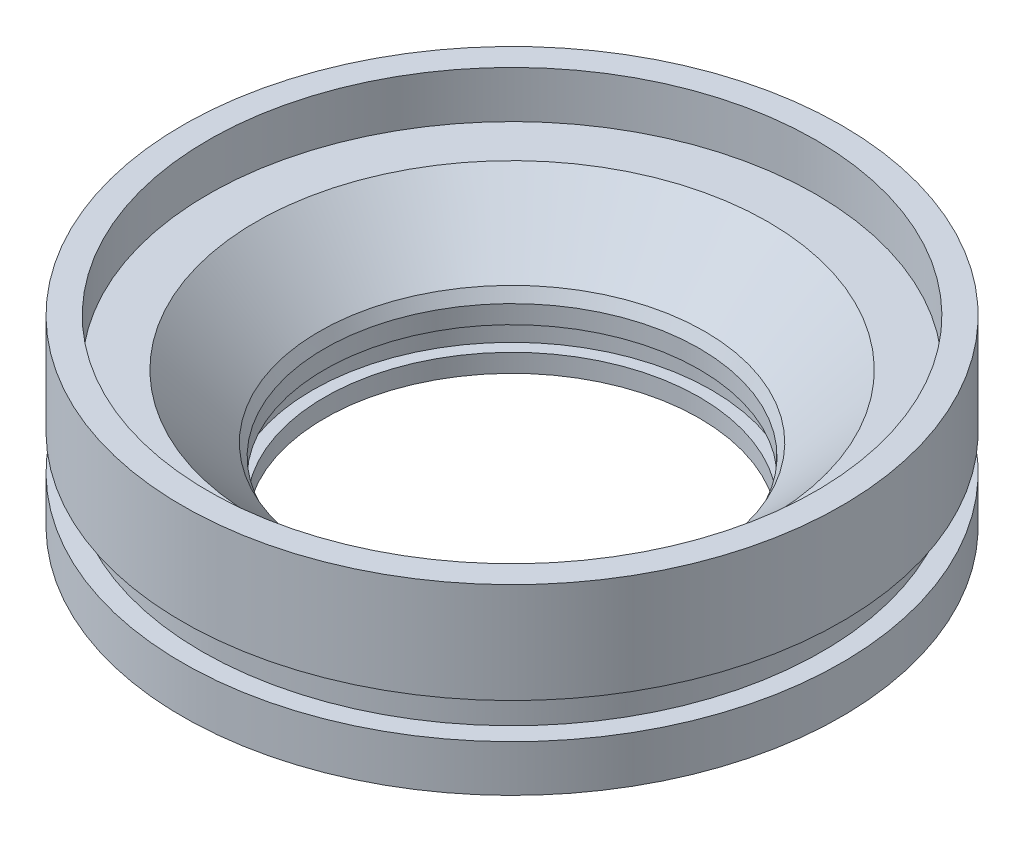
ISO-10303-21;
HEADER;
FILE_DESCRIPTION(('STEP AP214'),'2;1');
FILE_NAME('part.step','',(''),(''),'','','');
FILE_SCHEMA(('AUTOMOTIVE_DESIGN { 1 0 10303 214 1 1 1 1 }'));
ENDSEC;
DATA;
#1=APPLICATION_CONTEXT('core data for automotive mechanical design processes');
#2=APPLICATION_PROTOCOL_DEFINITION('international standard','automotive_design',2000,#1);
#3=PRODUCT_CONTEXT('',#1,'mechanical');
#4=PRODUCT('Part','Part','',(#3));
#5=PRODUCT_RELATED_PRODUCT_CATEGORY('part','',(#4));
#6=PRODUCT_DEFINITION_FORMATION('','',#4);
#7=PRODUCT_DEFINITION_CONTEXT('part definition',#1,'design');
#8=PRODUCT_DEFINITION('design','',#6,#7);
#9=PRODUCT_DEFINITION_SHAPE('','',#8);
#10=(LENGTH_UNIT() NAMED_UNIT(*) SI_UNIT(.MILLI.,.METRE.));
#11=(NAMED_UNIT(*) PLANE_ANGLE_UNIT() SI_UNIT($,.RADIAN.));
#12=(NAMED_UNIT(*) SI_UNIT($,.STERADIAN.) SOLID_ANGLE_UNIT());
#13=UNCERTAINTY_MEASURE_WITH_UNIT(LENGTH_MEASURE(1.E-05),#10,'distance_accuracy_value','');
#14=(GEOMETRIC_REPRESENTATION_CONTEXT(3) GLOBAL_UNCERTAINTY_ASSIGNED_CONTEXT((#13)) GLOBAL_UNIT_ASSIGNED_CONTEXT((#10,
#11,#12)) REPRESENTATION_CONTEXT('',''));
#15=CARTESIAN_POINT('',(0.,0.,0.));
#16=DIRECTION('',(0.,0.,1.));
#17=DIRECTION('',(1.,0.,0.));
#18=AXIS2_PLACEMENT_3D('',#15,#16,#17);
#19=CARTESIAN_POINT('',(45.8597,0.,0.));
#20=DIRECTION('',(0.,-1.,0.));
#21=DIRECTION('',(0.,0.,-1.));
#22=AXIS2_PLACEMENT_3D('',#19,#20,#21);
#23=PLANE('',#22);
#24=CARTESIAN_POINT('',(0.,0.,0.));
#25=DIRECTION('',(0.,-1.,0.));
#26=DIRECTION('',(0.,0.,-1.));
#27=AXIS2_PLACEMENT_3D('',#24,#25,#26);
#28=CIRCLE('',#27,45.8597);
#29=CARTESIAN_POINT('',(0.,0.,-45.8597));
#30=VERTEX_POINT('',#29);
#31=EDGE_CURVE('E84',#30,#30,#28,.T.);
#32=ORIENTED_EDGE('',*,*,#31,.T.);
#33=EDGE_LOOP('',(#32));
#34=FACE_BOUND('',#33,.T.);
#35=CARTESIAN_POINT('',(0.,0.,0.));
#36=DIRECTION('',(0.,-1.,0.));
#37=DIRECTION('',(0.,0.,-1.));
#38=AXIS2_PLACEMENT_3D('',#35,#36,#37);
#39=CIRCLE('',#38,26.0731);
#40=CARTESIAN_POINT('',(0.,0.,-26.0731));
#41=VERTEX_POINT('',#40);
#42=EDGE_CURVE('E10',#41,#41,#39,.T.);
#43=ORIENTED_EDGE('',*,*,#42,.F.);
#44=EDGE_LOOP('',(#43));
#45=FACE_BOUND('',#44,.T.);
#46=ADVANCED_FACE('F32',(#34,#45),#23,.T.);
#47=CARTESIAN_POINT('',(0.,0.,0.));
#48=DIRECTION('',(0.,-1.,0.));
#49=DIRECTION('',(0.,0.,-1.));
#50=AXIS2_PLACEMENT_3D('',#47,#48,#49);
#51=CYLINDRICAL_SURFACE('',#50,26.0731);
#52=ORIENTED_EDGE('',*,*,#42,.T.);
#53=EDGE_LOOP('',(#52));
#54=FACE_BOUND('',#53,.T.);
#55=CARTESIAN_POINT('',(0.,2.54,0.));
#56=DIRECTION('',(0.,-1.,0.));
#57=DIRECTION('',(0.,0.,-1.));
#58=AXIS2_PLACEMENT_3D('',#55,#56,#57);
#59=CIRCLE('',#58,26.0731);
#60=CARTESIAN_POINT('',(0.,2.54,-26.0731));
#61=VERTEX_POINT('',#60);
#62=EDGE_CURVE('E38',#61,#61,#59,.T.);
#63=ORIENTED_EDGE('',*,*,#62,.F.);
#64=EDGE_LOOP('',(#63));
#65=FACE_BOUND('',#64,.T.);
#66=ADVANCED_FACE('F102',(#54,#65),#51,.F.);
#67=CARTESIAN_POINT('',(26.0731,2.54,0.));
#68=DIRECTION('',(0.,1.,0.));
#69=DIRECTION('',(0.,0.,1.));
#70=AXIS2_PLACEMENT_3D('',#67,#68,#69);
#71=PLANE('',#70);
#72=ORIENTED_EDGE('',*,*,#62,.T.);
#73=EDGE_LOOP('',(#72));
#74=FACE_BOUND('',#73,.T.);
#75=CARTESIAN_POINT('',(0.,2.54,0.));
#76=DIRECTION('',(0.,-1.,0.));
#77=DIRECTION('',(0.,0.,-1.));
#78=AXIS2_PLACEMENT_3D('',#75,#76,#77);
#79=CIRCLE('',#78,27.7723101921424);
#80=CARTESIAN_POINT('',(0.,2.54,-27.7723101921424));
#81=VERTEX_POINT('',#80);
#82=EDGE_CURVE('E42',#81,#81,#79,.T.);
#83=ORIENTED_EDGE('',*,*,#82,.F.);
#84=EDGE_LOOP('',(#83));
#85=FACE_BOUND('',#84,.T.);
#86=ADVANCED_FACE('F106',(#74,#85),#71,.T.);
#87=CARTESIAN_POINT('',(0.,0.,0.));
#88=DIRECTION('',(0.,-1.,0.));
#89=DIRECTION('',(0.,0.,-1.));
#90=AXIS2_PLACEMENT_3D('',#87,#88,#89);
#91=CYLINDRICAL_SURFACE('',#90,27.7723101921424);
#92=ORIENTED_EDGE('',*,*,#82,.T.);
#93=EDGE_LOOP('',(#92));
#94=FACE_BOUND('',#93,.T.);
#95=CARTESIAN_POINT('',(0.,5.8674,0.));
#96=DIRECTION('',(0.,-1.,0.));
#97=DIRECTION('',(0.,0.,-1.));
#98=AXIS2_PLACEMENT_3D('',#95,#96,#97);
#99=CIRCLE('',#98,27.7723101921424);
#100=CARTESIAN_POINT('',(0.,5.8674,-27.7723101921424));
#101=VERTEX_POINT('',#100);
#102=EDGE_CURVE('E46',#101,#101,#99,.T.);
#103=ORIENTED_EDGE('',*,*,#102,.F.);
#104=EDGE_LOOP('',(#103));
#105=FACE_BOUND('',#104,.T.);
#106=ADVANCED_FACE('F110',(#94,#105),#91,.F.);
#107=CARTESIAN_POINT('',(27.7723101921424,5.8674,0.));
#108=DIRECTION('',(0.,-1.,0.));
#109=DIRECTION('',(0.,0.,-1.));
#110=AXIS2_PLACEMENT_3D('',#107,#108,#109);
#111=PLANE('',#110);
#112=ORIENTED_EDGE('',*,*,#102,.T.);
#113=EDGE_LOOP('',(#112));
#114=FACE_BOUND('',#113,.T.);
#115=CARTESIAN_POINT('',(0.,5.8674,0.));
#116=DIRECTION('',(0.,-1.,0.));
#117=DIRECTION('',(0.,0.,-1.));
#118=AXIS2_PLACEMENT_3D('',#115,#116,#117);
#119=CIRCLE('',#118,26.0731);
#120=CARTESIAN_POINT('',(0.,5.8674,-26.0731));
#121=VERTEX_POINT('',#120);
#122=EDGE_CURVE('E51',#121,#121,#119,.T.);
#123=ORIENTED_EDGE('',*,*,#122,.F.);
#124=EDGE_LOOP('',(#123));
#125=FACE_BOUND('',#124,.T.);
#126=ADVANCED_FACE('F116',(#114,#125),#111,.T.);
#127=CARTESIAN_POINT('',(0.,0.,0.));
#128=DIRECTION('',(0.,-1.,0.));
#129=DIRECTION('',(0.,0.,-1.));
#130=AXIS2_PLACEMENT_3D('',#127,#128,#129);
#131=CYLINDRICAL_SURFACE('',#130,26.0731);
#132=ORIENTED_EDGE('',*,*,#122,.T.);
#133=EDGE_LOOP('',(#132));
#134=FACE_BOUND('',#133,.T.);
#135=CARTESIAN_POINT('',(0.,8.4074,0.));
#136=DIRECTION('',(0.,-1.,0.));
#137=DIRECTION('',(0.,0.,-1.));
#138=AXIS2_PLACEMENT_3D('',#135,#136,#137);
#139=CIRCLE('',#138,26.0731);
#140=CARTESIAN_POINT('',(0.,8.4074,-26.0731));
#141=VERTEX_POINT('',#140);
#142=EDGE_CURVE('E54',#141,#141,#139,.T.);
#143=ORIENTED_EDGE('',*,*,#142,.F.);
#144=EDGE_LOOP('',(#143));
#145=FACE_BOUND('',#144,.T.);
#146=ADVANCED_FACE('F120',(#134,#145),#131,.F.);
#147=CARTESIAN_POINT('',(0.,10.06856,0.));
#148=DIRECTION('',(0.,1.,0.));
#149=DIRECTION('',(0.,0.,1.));
#150=AXIS2_PLACEMENT_3D('',#147,#148,#149);
#151=CONICAL_SURFACE('',#150,26.8351,0.430078135055869);
#152=ORIENTED_EDGE('',*,*,#142,.T.);
#153=EDGE_LOOP('',(#152));
#154=FACE_BOUND('',#153,.T.);
#155=CARTESIAN_POINT('',(0.,10.06856,0.));
#156=DIRECTION('',(0.,-1.,0.));
#157=DIRECTION('',(0.,0.,-1.));
#158=AXIS2_PLACEMENT_3D('',#155,#156,#157);
#159=CIRCLE('',#158,26.8351);
#160=CARTESIAN_POINT('',(0.,10.06856,-26.8351));
#161=VERTEX_POINT('',#160);
#162=EDGE_CURVE('E57',#161,#161,#159,.T.);
#163=ORIENTED_EDGE('',*,*,#162,.F.);
#164=EDGE_LOOP('',(#163));
#165=FACE_BOUND('',#164,.T.);
#166=ADVANCED_FACE('F124',(#154,#165),#151,.F.);
#167=CARTESIAN_POINT('',(0.,18.8722,0.));
#168=DIRECTION('',(0.,1.,0.));
#169=DIRECTION('',(0.,0.,1.));
#170=AXIS2_PLACEMENT_3D('',#167,#168,#169);
#171=CONICAL_SURFACE('',#170,35.63874,0.785398163397446);
#172=ORIENTED_EDGE('',*,*,#162,.T.);
#173=EDGE_LOOP('',(#172));
#174=FACE_BOUND('',#173,.T.);
#175=CARTESIAN_POINT('',(0.,18.8722,0.));
#176=DIRECTION('',(0.,-1.,0.));
#177=DIRECTION('',(0.,0.,-1.));
#178=AXIS2_PLACEMENT_3D('',#175,#176,#177);
#179=CIRCLE('',#178,35.63874);
#180=CARTESIAN_POINT('',(0.,18.8722,-35.63874));
#181=VERTEX_POINT('',#180);
#182=EDGE_CURVE('E60',#181,#181,#179,.T.);
#183=ORIENTED_EDGE('',*,*,#182,.F.);
#184=EDGE_LOOP('',(#183));
#185=FACE_BOUND('',#184,.T.);
#186=ADVANCED_FACE('F128',(#174,#185),#171,.F.);
#187=CARTESIAN_POINT('',(35.63874,18.8722,0.));
#188=DIRECTION('',(0.,1.,0.));
#189=DIRECTION('',(0.,0.,1.));
#190=AXIS2_PLACEMENT_3D('',#187,#188,#189);
#191=PLANE('',#190);
#192=ORIENTED_EDGE('',*,*,#182,.T.);
#193=EDGE_LOOP('',(#192));
#194=FACE_BOUND('',#193,.T.);
#195=CARTESIAN_POINT('',(0.,18.8722,0.));
#196=DIRECTION('',(0.,-1.,0.));
#197=DIRECTION('',(0.,0.,-1.));
#198=AXIS2_PLACEMENT_3D('',#195,#196,#197);
#199=CIRCLE('',#198,42.29354);
#200=CARTESIAN_POINT('',(0.,18.8722,-42.29354));
#201=VERTEX_POINT('',#200);
#202=EDGE_CURVE('E63',#201,#201,#199,.T.);
#203=ORIENTED_EDGE('',*,*,#202,.F.);
#204=EDGE_LOOP('',(#203));
#205=FACE_BOUND('',#204,.T.);
#206=ADVANCED_FACE('F132',(#194,#205),#191,.T.);
#207=CARTESIAN_POINT('',(0.,0.,0.));
#208=DIRECTION('',(0.,-1.,0.));
#209=DIRECTION('',(0.,0.,-1.));
#210=AXIS2_PLACEMENT_3D('',#207,#208,#209);
#211=CYLINDRICAL_SURFACE('',#210,42.29354);
#212=ORIENTED_EDGE('',*,*,#202,.T.);
#213=EDGE_LOOP('',(#212));
#214=FACE_BOUND('',#213,.T.);
#215=CARTESIAN_POINT('',(0.,25.4,0.));
#216=DIRECTION('',(0.,-1.,0.));
#217=DIRECTION('',(0.,0.,-1.));
#218=AXIS2_PLACEMENT_3D('',#215,#216,#217);
#219=CIRCLE('',#218,42.29354);
#220=CARTESIAN_POINT('',(0.,25.4,-42.29354));
#221=VERTEX_POINT('',#220);
#222=EDGE_CURVE('E66',#221,#221,#219,.T.);
#223=ORIENTED_EDGE('',*,*,#222,.F.);
#224=EDGE_LOOP('',(#223));
#225=FACE_BOUND('',#224,.T.);
#226=ADVANCED_FACE('F136',(#214,#225),#211,.F.);
#227=CARTESIAN_POINT('',(42.29354,25.4,0.));
#228=DIRECTION('',(0.,1.,0.));
#229=DIRECTION('',(0.,0.,1.));
#230=AXIS2_PLACEMENT_3D('',#227,#228,#229);
#231=PLANE('',#230);
#232=ORIENTED_EDGE('',*,*,#222,.T.);
#233=EDGE_LOOP('',(#232));
#234=FACE_BOUND('',#233,.T.);
#235=CARTESIAN_POINT('',(0.,25.4,0.));
#236=DIRECTION('',(0.,-1.,0.));
#237=DIRECTION('',(0.,0.,-1.));
#238=AXIS2_PLACEMENT_3D('',#235,#236,#237);
#239=CIRCLE('',#238,45.8597);
#240=CARTESIAN_POINT('',(0.,25.4,-45.8597));
#241=VERTEX_POINT('',#240);
#242=EDGE_CURVE('E69',#241,#241,#239,.T.);
#243=ORIENTED_EDGE('',*,*,#242,.F.);
#244=EDGE_LOOP('',(#243));
#245=FACE_BOUND('',#244,.T.);
#246=ADVANCED_FACE('F140',(#234,#245),#231,.T.);
#247=CARTESIAN_POINT('',(0.,0.,0.));
#248=DIRECTION('',(0.,-1.,0.));
#249=DIRECTION('',(0.,0.,-1.));
#250=AXIS2_PLACEMENT_3D('',#247,#248,#249);
#251=CYLINDRICAL_SURFACE('',#250,45.8597);
#252=ORIENTED_EDGE('',*,*,#242,.T.);
#253=EDGE_LOOP('',(#252));
#254=FACE_BOUND('',#253,.T.);
#255=CARTESIAN_POINT('',(0.,11.43,0.));
#256=DIRECTION('',(0.,-1.,0.));
#257=DIRECTION('',(0.,0.,-1.));
#258=AXIS2_PLACEMENT_3D('',#255,#256,#257);
#259=CIRCLE('',#258,45.8597);
#260=CARTESIAN_POINT('',(0.,11.43,-45.8597));
#261=VERTEX_POINT('',#260);
#262=EDGE_CURVE('E72',#261,#261,#259,.T.);
#263=ORIENTED_EDGE('',*,*,#262,.F.);
#264=EDGE_LOOP('',(#263));
#265=FACE_BOUND('',#264,.T.);
#266=ADVANCED_FACE('F144',(#254,#265),#251,.T.);
#267=CARTESIAN_POINT('',(45.8597,11.43,0.));
#268=DIRECTION('',(0.,-1.,0.));
#269=DIRECTION('',(0.,0.,-1.));
#270=AXIS2_PLACEMENT_3D('',#267,#268,#269);
#271=PLANE('',#270);
#272=ORIENTED_EDGE('',*,*,#262,.T.);
#273=EDGE_LOOP('',(#272));
#274=FACE_BOUND('',#273,.T.);
#275=CARTESIAN_POINT('',(0.,11.43,0.));
#276=DIRECTION('',(0.,-1.,0.));
#277=DIRECTION('',(0.,0.,-1.));
#278=AXIS2_PLACEMENT_3D('',#275,#276,#277);
#279=CIRCLE('',#278,43.1419);
#280=CARTESIAN_POINT('',(0.,11.43,-43.1419));
#281=VERTEX_POINT('',#280);
#282=EDGE_CURVE('E75',#281,#281,#279,.T.);
#283=ORIENTED_EDGE('',*,*,#282,.F.);
#284=EDGE_LOOP('',(#283));
#285=FACE_BOUND('',#284,.T.);
#286=ADVANCED_FACE('F148',(#274,#285),#271,.T.);
#287=CARTESIAN_POINT('',(0.,0.,0.));
#288=DIRECTION('',(0.,-1.,0.));
#289=DIRECTION('',(0.,0.,-1.));
#290=AXIS2_PLACEMENT_3D('',#287,#288,#289);
#291=CYLINDRICAL_SURFACE('',#290,43.1419);
#292=ORIENTED_EDGE('',*,*,#282,.T.);
#293=EDGE_LOOP('',(#292));
#294=FACE_BOUND('',#293,.T.);
#295=CARTESIAN_POINT('',(0.,6.477,0.));
#296=DIRECTION('',(0.,-1.,0.));
#297=DIRECTION('',(0.,0.,-1.));
#298=AXIS2_PLACEMENT_3D('',#295,#296,#297);
#299=CIRCLE('',#298,43.1419);
#300=CARTESIAN_POINT('',(0.,6.477,-43.1419));
#301=VERTEX_POINT('',#300);
#302=EDGE_CURVE('E78',#301,#301,#299,.T.);
#303=ORIENTED_EDGE('',*,*,#302,.F.);
#304=EDGE_LOOP('',(#303));
#305=FACE_BOUND('',#304,.T.);
#306=ADVANCED_FACE('F98',(#294,#305),#291,.T.);
#307=CARTESIAN_POINT('',(43.1419,6.477,0.));
#308=DIRECTION('',(0.,1.,0.));
#309=DIRECTION('',(0.,0.,1.));
#310=AXIS2_PLACEMENT_3D('',#307,#308,#309);
#311=PLANE('',#310);
#312=ORIENTED_EDGE('',*,*,#302,.T.);
#313=EDGE_LOOP('',(#312));
#314=FACE_BOUND('',#313,.T.);
#315=CARTESIAN_POINT('',(0.,6.477,0.));
#316=DIRECTION('',(0.,-1.,0.));
#317=DIRECTION('',(0.,0.,-1.));
#318=AXIS2_PLACEMENT_3D('',#315,#316,#317);
#319=CIRCLE('',#318,45.8597);
#320=CARTESIAN_POINT('',(0.,6.477,-45.8597));
#321=VERTEX_POINT('',#320);
#322=EDGE_CURVE('E81',#321,#321,#319,.T.);
#323=ORIENTED_EDGE('',*,*,#322,.F.);
#324=EDGE_LOOP('',(#323));
#325=FACE_BOUND('',#324,.T.);
#326=ADVANCED_FACE('F92',(#314,#325),#311,.T.);
#327=CARTESIAN_POINT('',(0.,0.,0.));
#328=DIRECTION('',(0.,-1.,0.));
#329=DIRECTION('',(0.,0.,-1.));
#330=AXIS2_PLACEMENT_3D('',#327,#328,#329);
#331=CYLINDRICAL_SURFACE('',#330,45.8597);
#332=ORIENTED_EDGE('',*,*,#322,.T.);
#333=EDGE_LOOP('',(#332));
#334=FACE_BOUND('',#333,.T.);
#335=ORIENTED_EDGE('',*,*,#31,.F.);
#336=EDGE_LOOP('',(#335));
#337=FACE_BOUND('',#336,.T.);
#338=ADVANCED_FACE('F90',(#334,#337),#331,.T.);
#339=CLOSED_SHELL('',(#46,#66,#86,#106,#126,#146,#166,#186,#206,#226,#246,#266,#286,#306,#326,#338));
#340=MANIFOLD_SOLID_BREP('B2',#339);
#341=ADVANCED_BREP_SHAPE_REPRESENTATION('',(#18,#340),#14);
#342=SHAPE_DEFINITION_REPRESENTATION(#9,#341);
ENDSEC;
END-ISO-10303-21;
